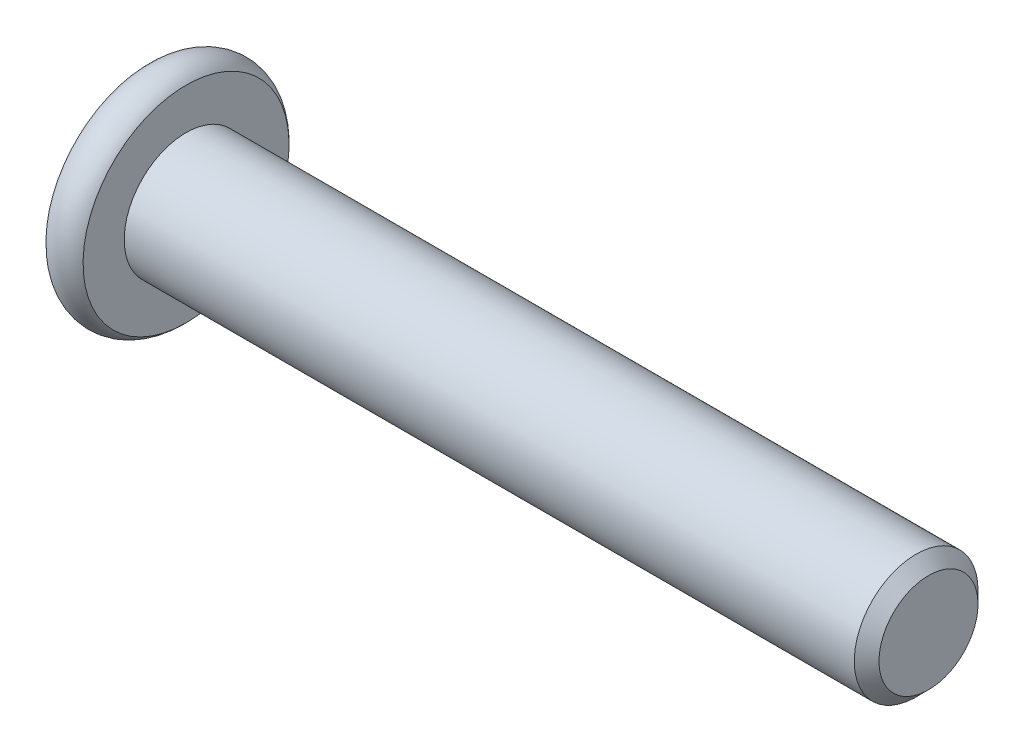
ISO-10303-21;
HEADER;
FILE_DESCRIPTION(('STEP AP214'),'2;1');
FILE_NAME('part.step','',(''),(''),'','','');
FILE_SCHEMA(('AUTOMOTIVE_DESIGN { 1 0 10303 214 1 1 1 1 }'));
ENDSEC;
DATA;
#1=APPLICATION_CONTEXT('core data for automotive mechanical design processes');
#2=APPLICATION_PROTOCOL_DEFINITION('international standard','automotive_design',2000,#1);
#3=PRODUCT_CONTEXT('',#1,'mechanical');
#4=PRODUCT('Part','Part','',(#3));
#5=PRODUCT_RELATED_PRODUCT_CATEGORY('part','',(#4));
#6=PRODUCT_DEFINITION_FORMATION('','',#4);
#7=PRODUCT_DEFINITION_CONTEXT('part definition',#1,'design');
#8=PRODUCT_DEFINITION('design','',#6,#7);
#9=PRODUCT_DEFINITION_SHAPE('','',#8);
#10=(LENGTH_UNIT() NAMED_UNIT(*) SI_UNIT(.MILLI.,.METRE.));
#11=(NAMED_UNIT(*) PLANE_ANGLE_UNIT() SI_UNIT($,.RADIAN.));
#12=(NAMED_UNIT(*) SI_UNIT($,.STERADIAN.) SOLID_ANGLE_UNIT());
#13=UNCERTAINTY_MEASURE_WITH_UNIT(LENGTH_MEASURE(1.E-05),#10,'distance_accuracy_value','');
#14=(GEOMETRIC_REPRESENTATION_CONTEXT(3) GLOBAL_UNCERTAINTY_ASSIGNED_CONTEXT((#13)) GLOBAL_UNIT_ASSIGNED_CONTEXT((#10,
#11,#12)) REPRESENTATION_CONTEXT('',''));
#15=CARTESIAN_POINT('',(0.,0.,0.));
#16=DIRECTION('',(0.,0.,1.));
#17=DIRECTION('',(1.,0.,0.));
#18=AXIS2_PLACEMENT_3D('',#15,#16,#17);
#19=CARTESIAN_POINT('',(-30.,0.,0.));
#20=DIRECTION('',(1.,0.,0.));
#21=DIRECTION('',(0.,0.,-1.));
#22=AXIS2_PLACEMENT_3D('',#19,#20,#21);
#23=CYLINDRICAL_SURFACE('',#22,2.5);
#24=CARTESIAN_POINT('',(-0.500000000000004,0.,0.));
#25=DIRECTION('',(1.,0.,0.));
#26=DIRECTION('',(0.,0.,-1.));
#27=AXIS2_PLACEMENT_3D('',#24,#25,#26);
#28=CIRCLE('',#27,2.5);
#29=CARTESIAN_POINT('',(-0.500000000000004,0.,-2.5));
#30=VERTEX_POINT('',#29);
#31=EDGE_CURVE('E45',#30,#30,#28,.F.);
#32=ORIENTED_EDGE('',*,*,#31,.T.);
#33=EDGE_LOOP('',(#32));
#34=FACE_BOUND('',#33,.T.);
#35=CARTESIAN_POINT('',(-30.,0.,0.));
#36=DIRECTION('',(-1.,0.,0.));
#37=DIRECTION('',(0.,-1.,0.));
#38=AXIS2_PLACEMENT_3D('',#35,#36,#37);
#39=CIRCLE('',#38,2.5);
#40=CARTESIAN_POINT('',(-30.,-2.50000000000001,0.));
#41=VERTEX_POINT('',#40);
#42=EDGE_CURVE('E121',#41,#41,#39,.F.);
#43=ORIENTED_EDGE('',*,*,#42,.T.);
#44=EDGE_LOOP('',(#43));
#45=FACE_BOUND('',#44,.T.);
#46=ADVANCED_FACE('F32',(#34,#45),#23,.T.);
#47=CARTESIAN_POINT('',(0.,0.,0.));
#48=DIRECTION('',(1.,0.,0.));
#49=DIRECTION('',(0.,0.,-1.));
#50=AXIS2_PLACEMENT_3D('',#47,#48,#49);
#51=PLANE('',#50);
#52=CARTESIAN_POINT('',(0.,0.,0.));
#53=DIRECTION('',(1.,0.,0.));
#54=DIRECTION('',(0.,0.,-1.));
#55=AXIS2_PLACEMENT_3D('',#52,#53,#54);
#56=CIRCLE('',#55,1.99999999999999);
#57=CARTESIAN_POINT('',(0.,0.,-1.99999999999999));
#58=VERTEX_POINT('',#57);
#59=EDGE_CURVE('E124',#58,#58,#56,.T.);
#60=ORIENTED_EDGE('',*,*,#59,.T.);
#61=EDGE_LOOP('',(#60));
#62=FACE_BOUND('',#61,.T.);
#63=ADVANCED_FACE('F134',(#62),#51,.T.);
#64=CARTESIAN_POINT('',(0.,0.,0.));
#65=DIRECTION('',(-1.,0.,0.));
#66=DIRECTION('',(0.,0.,1.));
#67=AXIS2_PLACEMENT_3D('',#64,#65,#66);
#68=CONICAL_SURFACE('',#67,1.99999999999999,0.785398163397447);
#69=ORIENTED_EDGE('',*,*,#31,.F.);
#70=EDGE_LOOP('',(#69));
#71=FACE_BOUND('',#70,.T.);
#72=ORIENTED_EDGE('',*,*,#59,.F.);
#73=EDGE_LOOP('',(#72));
#74=FACE_BOUND('',#73,.T.);
#75=ADVANCED_FACE('F34',(#71,#74),#68,.T.);
#76=CARTESIAN_POINT('',(-31.5,0.,0.));
#77=DIRECTION('',(1.,0.,0.));
#78=DIRECTION('',(0.,1.,0.));
#79=AXIS2_PLACEMENT_3D('',#76,#77,#78);
#80=PLANE('',#79);
#81=CARTESIAN_POINT('',(-31.5,1.20258491862594E-13,0.));
#82=DIRECTION('',(-1.,0.,0.));
#83=DIRECTION('',(0.,-1.,0.));
#84=AXIS2_PLACEMENT_3D('',#81,#82,#83);
#85=CIRCLE('',#84,1.78205080756884);
#86=CARTESIAN_POINT('',(-31.5,-1.78205080756872,0.));
#87=VERTEX_POINT('',#86);
#88=EDGE_CURVE('E234',#87,#87,#85,.T.);
#89=ORIENTED_EDGE('',*,*,#88,.F.);
#90=EDGE_LOOP('',(#89));
#91=FACE_BOUND('',#90,.T.);
#92=CARTESIAN_POINT('',(-31.5,0.,0.));
#93=DIRECTION('',(-1.,0.,0.));
#94=DIRECTION('',(0.,-1.,0.));
#95=AXIS2_PLACEMENT_3D('',#92,#93,#94);
#96=CIRCLE('',#95,4.16143782776615);
#97=CARTESIAN_POINT('',(-31.5,-4.16143782776615,0.));
#98=VERTEX_POINT('',#97);
#99=EDGE_CURVE('E118',#98,#98,#96,.T.);
#100=ORIENTED_EDGE('',*,*,#99,.T.);
#101=EDGE_LOOP('',(#100));
#102=FACE_BOUND('',#101,.T.);
#103=ADVANCED_FACE('F133',(#91,#102),#80,.F.);
#104=CARTESIAN_POINT('',(-30.75,0.,0.));
#105=DIRECTION('',(-1.,0.,0.));
#106=DIRECTION('',(0.,-1.,0.));
#107=AXIS2_PLACEMENT_3D('',#104,#105,#106);
#108=TOROIDAL_SURFACE('',#107,3.5,1.);
#109=ORIENTED_EDGE('',*,*,#99,.F.);
#110=EDGE_LOOP('',(#109));
#111=FACE_BOUND('',#110,.T.);
#112=CARTESIAN_POINT('',(-30.,0.,0.));
#113=DIRECTION('',(-1.,0.,0.));
#114=DIRECTION('',(0.,-1.,0.));
#115=AXIS2_PLACEMENT_3D('',#112,#113,#114);
#116=CIRCLE('',#115,4.16143782776615);
#117=CARTESIAN_POINT('',(-30.,-4.16143782776615,0.));
#118=VERTEX_POINT('',#117);
#119=EDGE_CURVE('E115',#118,#118,#116,.T.);
#120=ORIENTED_EDGE('',*,*,#119,.T.);
#121=EDGE_LOOP('',(#120));
#122=FACE_BOUND('',#121,.T.);
#123=ADVANCED_FACE('F145',(#111,#122),#108,.T.);
#124=CARTESIAN_POINT('',(-30.,4.16143782776615,0.));
#125=DIRECTION('',(-1.,0.,0.));
#126=DIRECTION('',(0.,-1.,0.));
#127=AXIS2_PLACEMENT_3D('',#124,#125,#126);
#128=PLANE('',#127);
#129=ORIENTED_EDGE('',*,*,#42,.F.);
#130=EDGE_LOOP('',(#129));
#131=FACE_BOUND('',#130,.T.);
#132=ORIENTED_EDGE('',*,*,#119,.F.);
#133=EDGE_LOOP('',(#132));
#134=FACE_BOUND('',#133,.T.);
#135=ADVANCED_FACE('F149',(#131,#134),#128,.F.);
#136=CARTESIAN_POINT('',(-31.5,1.20258491862594E-13,0.));
#137=DIRECTION('',(-1.,0.,0.));
#138=DIRECTION('',(0.,-1.,0.));
#139=AXIS2_PLACEMENT_3D('',#136,#137,#138);
#140=CONICAL_SURFACE('',#139,1.78205080756884,0.78539816339745);
#141=ORIENTED_EDGE('',*,*,#88,.T.);
#142=EDGE_LOOP('',(#141));
#143=FACE_BOUND('',#142,.T.);
#144=CARTESIAN_POINT('',(-32.015428085613,-1.74023253176568,1.5));
#145=CARTESIAN_POINT('',(-31.9833811073445,-1.69791724929722,1.5));
#146=CARTESIAN_POINT('',(-31.9516444672841,-1.65536760966783,1.5));
#147=CARTESIAN_POINT('',(-31.8889203936153,-1.56970398156676,1.5));
#148=CARTESIAN_POINT('',(-31.85793314822,-1.52658985542839,1.5));
#149=CARTESIAN_POINT('',(-31.765846164345,-1.39562626326554,1.5));
#150=CARTESIAN_POINT('',(-31.7061145123021,-1.30679868010567,1.5));
#151=CARTESIAN_POINT('',(-31.5887342891012,-1.12044622640206,1.5));
#152=CARTESIAN_POINT('',(-31.5314082774823,-1.02271587306664,1.5));
#153=CARTESIAN_POINT('',(-31.426463214976,-0.82235721496517,1.5));
#154=CARTESIAN_POINT('',(-31.3788114236896,-0.719746931701835,1.5));
#155=CARTESIAN_POINT('',(-31.3205099883151,-0.56585238709501,1.5));
#156=CARTESIAN_POINT('',(-31.3037990535409,-0.516874191424599,1.5));
#157=CARTESIAN_POINT('',(-31.2743077515089,-0.417723988457438,1.5));
#158=CARTESIAN_POINT('',(-31.2615276514219,-0.367551900263805,1.5));
#159=CARTESIAN_POINT('',(-31.2407784202458,-0.267158299056056,1.5));
#160=CARTESIAN_POINT('',(-31.232726061826,-0.216954261864791,1.5));
#161=CARTESIAN_POINT('',(-31.2215916368341,-0.115994915871257,1.5));
#162=CARTESIAN_POINT('',(-31.2185086886377,-0.065239706461475,1.5));
#163=CARTESIAN_POINT('',(-31.2175473897404,0.0344222234876207,1.5));
#164=CARTESIAN_POINT('',(-31.2194789216952,0.0833271701101549,1.5));
#165=CARTESIAN_POINT('',(-31.2280175729677,0.180724293127287,1.5));
#166=CARTESIAN_POINT('',(-31.234625142048,0.229216429361795,1.5));
#167=CARTESIAN_POINT('',(-31.2522650626447,0.326258027697074,1.5));
#168=CARTESIAN_POINT('',(-31.263373168201,0.374793507450095,1.5));
#169=CARTESIAN_POINT('',(-31.2894198669595,0.470802295834248,1.5));
#170=CARTESIAN_POINT('',(-31.3043581560035,0.518275688481351,1.5));
#171=CARTESIAN_POINT('',(-31.356839545716,0.667150562065199,1.5));
#172=CARTESIAN_POINT('',(-31.4003351165442,0.766448362426918,1.5));
#173=CARTESIAN_POINT('',(-31.4970587814836,0.960384405673904,1.5));
#174=CARTESIAN_POINT('',(-31.5503217226675,1.05500437383628,1.5));
#175=CARTESIAN_POINT('',(-31.6602258010454,1.23584520321539,1.5));
#176=CARTESIAN_POINT('',(-31.7165682531046,1.32224986946557,1.5));
#177=CARTESIAN_POINT('',(-31.803675572597,1.4495495372648,1.5));
#178=CARTESIAN_POINT('',(-31.8330199906839,1.4914336848243,1.5));
#179=CARTESIAN_POINT('',(-31.8924869182931,1.57462914783251,1.5));
#180=CARTESIAN_POINT('',(-31.9226092115007,1.61594061772586,1.5));
#181=CARTESIAN_POINT('',(-31.9530541181366,1.6570135874256,1.5));
#182=B_SPLINE_CURVE_WITH_KNOTS('',3,(#144,#145,#146,#147,#148,#149,#150,#151,#152,#153,#154,
#155,#156,#157,#158,#159,#160,#161,#162,#163,#164,#165,#166,#167,#168,#169,#170,#171,#172,#173,
#174,#175,#176,#177,#178,#179,#180,#181),.UNSPECIFIED.,.F.,.F.,(4,2,2,2,2,2,2,2,2,2,2,2,2,2,2,2,
2,2,4),(0.,0.159238974218351,0.318517535014541,0.639504781932385,0.979137893799192,
1.31760168934356,1.47272233841622,1.62785352839774,1.78016486537345,1.93244917778277,
2.07904486260296,2.22565464958331,2.37484213303397,2.52401777304038,2.84828365283773,
3.17372975666748,3.48303030530535,3.63644667013906,3.78982082222911),.UNSPECIFIED.);
#183=CARTESIAN_POINT('',(-31.45,-0.866025403784319,1.5));
#184=VERTEX_POINT('',#183);
#185=CARTESIAN_POINT('',(-31.45,0.866025403784558,1.5));
#186=VERTEX_POINT('',#185);
#187=EDGE_CURVE('E99',#184,#186,#182,.T.);
#188=ORIENTED_EDGE('',*,*,#187,.F.);
#189=CARTESIAN_POINT('',(-31.4501154816001,-1.73216627762259,-0.000200000000001104));
#190=CARTESIAN_POINT('',(-31.4203654760674,-1.70239359975903,0.0513677907370739));
#191=CARTESIAN_POINT('',(-31.3923624839104,-1.67212305186343,0.103797917665198));
#192=CARTESIAN_POINT('',(-31.3410892304402,-1.61039789003607,0.210709034055593));
#193=CARTESIAN_POINT('',(-31.3178475050444,-1.57893740312602,0.265200195814658));
#194=CARTESIAN_POINT('',(-31.2780337289923,-1.51549879897975,0.375079081357247));
#195=CARTESIAN_POINT('',(-31.2613615856709,-1.48353684526798,0.430438809095198));
#196=CARTESIAN_POINT('',(-31.2356744568181,-1.41890915196199,0.54237725747715));
#197=CARTESIAN_POINT('',(-31.2266402904789,-1.38624538781106,0.598952556553008));
#198=CARTESIAN_POINT('',(-31.2184890812269,-1.32995210095288,0.69645538951644));
#199=CARTESIAN_POINT('',(-31.2172822529893,-1.30639533311112,0.737256908280466));
#200=CARTESIAN_POINT('',(-31.2193140571623,-1.25932335290182,0.818787969615858));
#201=CARTESIAN_POINT('',(-31.2225536707483,-1.23580815085301,0.859517494314629));
#202=CARTESIAN_POINT('',(-31.233291985982,-1.18900414978415,0.940584402163415));
#203=CARTESIAN_POINT('',(-31.2407946530188,-1.16571558211708,0.980921384598288));
#204=CARTESIAN_POINT('',(-31.2596516119283,-1.11952932016323,1.06091833691403));
#205=CARTESIAN_POINT('',(-31.2710075570186,-1.09663179808774,1.10057800851621));
#206=CARTESIAN_POINT('',(-31.3047216475927,-1.03798159809686,1.20216313477448));
#207=CARTESIAN_POINT('',(-31.3296218490934,-1.00259267147453,1.26345855370969));
#208=CARTESIAN_POINT('',(-31.3716566532716,-0.950557780604255,1.35358562846331));
#209=CARTESIAN_POINT('',(-31.3864251535591,-0.933410759677029,1.38328513990771));
#210=CARTESIAN_POINT('',(-31.4173105659402,-0.899432101996288,1.44213790138375));
#211=CARTESIAN_POINT('',(-31.4334268341217,-0.882600319285591,1.47129140422064));
#212=CARTESIAN_POINT('',(-31.4501154816001,-0.865909933730481,1.5002));
#213=B_SPLINE_CURVE_WITH_KNOTS('',3,(#189,#190,#191,#192,#193,#194,#195,#196,#197,#198,#199,
#200,#201,#202,#203,#204,#205,#206,#207,#208,#209,#210,#211,#212),.UNSPECIFIED.,.F.,.F.,(4,2,2,
2,2,2,2,2,2,2,2,4),(0.,0.199829143693301,0.400822987382388,0.598623720538181,0.79592624018889,
0.937113067959882,1.07833105577193,1.21968061668222,1.36109089931054,1.58570969637566,
1.69770705470963,1.80965120737194),.UNSPECIFIED.);
#214=CARTESIAN_POINT('',(-31.45,-1.73205080756876,0.));
#215=VERTEX_POINT('',#214);
#216=EDGE_CURVE('E191',#215,#184,#213,.T.);
#217=ORIENTED_EDGE('',*,*,#216,.F.);
#218=CARTESIAN_POINT('',(-31.4501154816001,-0.86590993373048,-1.5002));
#219=CARTESIAN_POINT('',(-31.4203654760674,-0.895682611594045,-1.44863220926292));
#220=CARTESIAN_POINT('',(-31.3923624839104,-0.925953159489644,-1.3962020823348));
#221=CARTESIAN_POINT('',(-31.3410892304402,-0.987678321317002,-1.2892909659444));
#222=CARTESIAN_POINT('',(-31.3178475050444,-1.01913880822705,-1.23479980418534));
#223=CARTESIAN_POINT('',(-31.2780337289923,-1.08257741237332,-1.12492091864275));
#224=CARTESIAN_POINT('',(-31.2613615856709,-1.11453936608509,-1.0695611909048));
#225=CARTESIAN_POINT('',(-31.2356744568181,-1.17916705939108,-0.957622742522852));
#226=CARTESIAN_POINT('',(-31.2266402904789,-1.21183082354201,-0.901047443446994));
#227=CARTESIAN_POINT('',(-31.2184890812269,-1.2681241104002,-0.803544610483562));
#228=CARTESIAN_POINT('',(-31.2172822529893,-1.29168087824196,-0.762743091719536));
#229=CARTESIAN_POINT('',(-31.2193140571623,-1.33875285845126,-0.681212030384144));
#230=CARTESIAN_POINT('',(-31.2225536707483,-1.36226806050006,-0.640482505685373));
#231=CARTESIAN_POINT('',(-31.233291985982,-1.40907206156893,-0.559415597836587));
#232=CARTESIAN_POINT('',(-31.2407946530188,-1.432360629236,-0.519078615401715));
#233=CARTESIAN_POINT('',(-31.2596516119283,-1.47854689118984,-0.439081663085972));
#234=CARTESIAN_POINT('',(-31.2710075570186,-1.50144441326533,-0.399421991483795));
#235=CARTESIAN_POINT('',(-31.3047216475927,-1.56009461325621,-0.297836865225516));
#236=CARTESIAN_POINT('',(-31.3296218490934,-1.59548353987854,-0.236541446290311));
#237=CARTESIAN_POINT('',(-31.3716566532716,-1.64751843074882,-0.146414371536687));
#238=CARTESIAN_POINT('',(-31.3864251535591,-1.66466545167605,-0.116714860092284));
#239=CARTESIAN_POINT('',(-31.4173105659402,-1.69864410935679,-0.0578620986162512));
#240=CARTESIAN_POINT('',(-31.4334268341218,-1.71547589206749,-0.0287085957793639));
#241=CARTESIAN_POINT('',(-31.4501154816001,-1.73216627762259,0.000200000000000142));
#242=B_SPLINE_CURVE_WITH_KNOTS('',3,(#218,#219,#220,#221,#222,#223,#224,#225,#226,#227,#228,
#229,#230,#231,#232,#233,#234,#235,#236,#237,#238,#239,#240,#241),.UNSPECIFIED.,.F.,.F.,(4,2,2,
2,2,2,2,2,2,2,2,4),(0.,0.199829143693303,0.400822987382383,0.598623720538177,0.795926240188885,
0.937113067959877,1.07833105577192,1.21968061668221,1.36109089931054,1.58570969637565,
1.69770705470963,1.80965120737194),.UNSPECIFIED.);
#243=CARTESIAN_POINT('',(-31.45,-0.866025403784317,-1.5));
#244=VERTEX_POINT('',#243);
#245=EDGE_CURVE('E186',#244,#215,#242,.T.);
#246=ORIENTED_EDGE('',*,*,#245,.F.);
#247=CARTESIAN_POINT('',(-32.015428085613,-1.74023253176568,-1.5));
#248=CARTESIAN_POINT('',(-31.9833811073445,-1.69791724929721,-1.5));
#249=CARTESIAN_POINT('',(-31.9516444672841,-1.65536760966782,-1.5));
#250=CARTESIAN_POINT('',(-31.8889203936153,-1.56970398156675,-1.5));
#251=CARTESIAN_POINT('',(-31.85793314822,-1.52658985542839,-1.5));
#252=CARTESIAN_POINT('',(-31.765846164345,-1.39562626326554,-1.5));
#253=CARTESIAN_POINT('',(-31.7061145123021,-1.30679868010566,-1.5));
#254=CARTESIAN_POINT('',(-31.5887342891013,-1.12044622640206,-1.5));
#255=CARTESIAN_POINT('',(-31.5314082774823,-1.02271587306663,-1.5));
#256=CARTESIAN_POINT('',(-31.426463214976,-0.822357214965168,-1.5));
#257=CARTESIAN_POINT('',(-31.3788114236896,-0.719746931701833,-1.5));
#258=CARTESIAN_POINT('',(-31.3205099883151,-0.565852387095008,-1.5));
#259=CARTESIAN_POINT('',(-31.3037990535409,-0.516874191424597,-1.5));
#260=CARTESIAN_POINT('',(-31.2743077515089,-0.417723988457436,-1.5));
#261=CARTESIAN_POINT('',(-31.2615276514219,-0.367551900263803,-1.5));
#262=CARTESIAN_POINT('',(-31.2407784202458,-0.267158299056054,-1.5));
#263=CARTESIAN_POINT('',(-31.232726061826,-0.21695426186479,-1.5));
#264=CARTESIAN_POINT('',(-31.2215916368341,-0.115994915871256,-1.5));
#265=CARTESIAN_POINT('',(-31.2185086886377,-0.0652397064614737,-1.5));
#266=CARTESIAN_POINT('',(-31.2175473897404,0.0344222234876214,-1.5));
#267=CARTESIAN_POINT('',(-31.2194789216952,0.083327170110155,-1.5));
#268=CARTESIAN_POINT('',(-31.2280175729677,0.180724293127287,-1.5));
#269=CARTESIAN_POINT('',(-31.234625142048,0.229216429361795,-1.5));
#270=CARTESIAN_POINT('',(-31.2522650626447,0.326258027697074,-1.5));
#271=CARTESIAN_POINT('',(-31.263373168201,0.374793507450094,-1.5));
#272=CARTESIAN_POINT('',(-31.2894198669595,0.470802295834248,-1.5));
#273=CARTESIAN_POINT('',(-31.3043581560035,0.51827568848135,-1.5));
#274=CARTESIAN_POINT('',(-31.356839545716,0.667150562065198,-1.5));
#275=CARTESIAN_POINT('',(-31.4003351165442,0.766448362426916,-1.5));
#276=CARTESIAN_POINT('',(-31.4970587814836,0.960384405673901,-1.5));
#277=CARTESIAN_POINT('',(-31.5503217226675,1.05500437383627,-1.5));
#278=CARTESIAN_POINT('',(-31.6602258010454,1.23584520321538,-1.5));
#279=CARTESIAN_POINT('',(-31.7165682531046,1.32224986946556,-1.5));
#280=CARTESIAN_POINT('',(-31.803675572597,1.4495495372648,-1.5));
#281=CARTESIAN_POINT('',(-31.8330199906839,1.4914336848243,-1.5));
#282=CARTESIAN_POINT('',(-31.8924869182931,1.57462914783251,-1.5));
#283=CARTESIAN_POINT('',(-31.9226092115007,1.61594061772586,-1.5));
#284=CARTESIAN_POINT('',(-31.9530541181366,1.6570135874256,-1.5));
#285=B_SPLINE_CURVE_WITH_KNOTS('',3,(#247,#248,#249,#250,#251,#252,#253,#254,#255,#256,#257,
#258,#259,#260,#261,#262,#263,#264,#265,#266,#267,#268,#269,#270,#271,#272,#273,#274,#275,#276,
#277,#278,#279,#280,#281,#282,#283,#284),.UNSPECIFIED.,.F.,.F.,(4,2,2,2,2,2,2,2,2,2,2,2,2,2,2,2,
2,2,4),(0.,0.159238974218355,0.318517535014539,0.63950478193238,0.979137893799187,
1.31760168934355,1.47272233841622,1.62785352839774,1.78016486537344,1.93244917778277,
2.07904486260295,2.2256546495833,2.37484213303397,2.52401777304037,2.84828365283772,
3.17372975666747,3.48303030530534,3.63644667013906,3.7898208222291),.UNSPECIFIED.);
#286=CARTESIAN_POINT('',(-31.45,0.866025403784559,-1.5));
#287=VERTEX_POINT('',#286);
#288=EDGE_CURVE('E52',#287,#244,#285,.F.);
#289=ORIENTED_EDGE('',*,*,#288,.F.);
#290=CARTESIAN_POINT('',(-31.4501154816001,1.73216627762284,0.000200000000000434));
#291=CARTESIAN_POINT('',(-31.4203654760674,1.70239359975927,-0.0513677907370753));
#292=CARTESIAN_POINT('',(-31.3923624839103,1.67212305186367,-0.1037979176652));
#293=CARTESIAN_POINT('',(-31.3410892304402,1.61039789003631,-0.210709034055596));
#294=CARTESIAN_POINT('',(-31.3178475050444,1.57893740312626,-0.265200195814662));
#295=CARTESIAN_POINT('',(-31.2780337289922,1.51549879897999,-0.375079081357251));
#296=CARTESIAN_POINT('',(-31.2613615856709,1.48353684526822,-0.430438809095202));
#297=CARTESIAN_POINT('',(-31.2356744568181,1.41890915196223,-0.542377257477154));
#298=CARTESIAN_POINT('',(-31.2266402904789,1.3862453878113,-0.598952556553012));
#299=CARTESIAN_POINT('',(-31.2184890812269,1.32995210095311,-0.696455389516444));
#300=CARTESIAN_POINT('',(-31.2172822529892,1.30639533311136,-0.737256908280469));
#301=CARTESIAN_POINT('',(-31.2193140571623,1.25932335290205,-0.818787969615862));
#302=CARTESIAN_POINT('',(-31.2225536707483,1.23580815085325,-0.859517494314633));
#303=CARTESIAN_POINT('',(-31.233291985982,1.18900414978438,-0.940584402163419));
#304=CARTESIAN_POINT('',(-31.2407946530188,1.16571558211731,-0.980921384598291));
#305=CARTESIAN_POINT('',(-31.2596516119283,1.11952932016347,-1.06091833691403));
#306=CARTESIAN_POINT('',(-31.2710075570186,1.09663179808798,-1.10057800851621));
#307=CARTESIAN_POINT('',(-31.3047216475927,1.0379815980971,-1.20216313477449));
#308=CARTESIAN_POINT('',(-31.3296218490934,1.00259267147477,-1.26345855370969));
#309=CARTESIAN_POINT('',(-31.3716566532716,0.950557780604495,-1.35358562846331));
#310=CARTESIAN_POINT('',(-31.3864251535591,0.933410759677267,-1.38328513990772));
#311=CARTESIAN_POINT('',(-31.4173105659402,0.899432101996527,-1.44213790138375));
#312=CARTESIAN_POINT('',(-31.4334268341217,0.88260031928583,-1.47129140422064));
#313=CARTESIAN_POINT('',(-31.4501154816001,0.865909933730722,-1.5002));
#314=B_SPLINE_CURVE_WITH_KNOTS('',3,(#290,#291,#292,#293,#294,#295,#296,#297,#298,#299,#300,
#301,#302,#303,#304,#305,#306,#307,#308,#309,#310,#311,#312,#313),.UNSPECIFIED.,.F.,.F.,(4,2,2,
2,2,2,2,2,2,2,2,4),(0.,0.199829143693303,0.400822987382392,0.598623720538185,0.795926240188894,
0.937113067959886,1.07833105577193,1.21968061668222,1.36109089931055,1.58570969637566,
1.69770705470964,1.80965120737194),.UNSPECIFIED.);
#315=CARTESIAN_POINT('',(-31.45,1.732050807569,0.));
#316=VERTEX_POINT('',#315);
#317=EDGE_CURVE('E11',#316,#287,#314,.T.);
#318=ORIENTED_EDGE('',*,*,#317,.F.);
#319=CARTESIAN_POINT('',(-31.4501154816001,0.865909933730722,1.5002));
#320=CARTESIAN_POINT('',(-31.4203654760673,0.895682611594286,1.44863220926292));
#321=CARTESIAN_POINT('',(-31.3923624839103,0.925953159489885,1.3962020823348));
#322=CARTESIAN_POINT('',(-31.3410892304402,0.987678321317244,1.2892909659444));
#323=CARTESIAN_POINT('',(-31.3178475050444,1.01913880822729,1.23479980418534));
#324=CARTESIAN_POINT('',(-31.2780337289923,1.08257741237356,1.12492091864275));
#325=CARTESIAN_POINT('',(-31.2613615856709,1.11453936608533,1.0695611909048));
#326=CARTESIAN_POINT('',(-31.2356744568181,1.17916705939132,0.95762274252285));
#327=CARTESIAN_POINT('',(-31.2266402904789,1.21183082354225,0.901047443446991));
#328=CARTESIAN_POINT('',(-31.2184890812269,1.26812411040044,0.803544610483558));
#329=CARTESIAN_POINT('',(-31.2172822529892,1.2916808782422,0.762743091719532));
#330=CARTESIAN_POINT('',(-31.2193140571623,1.3387528584515,0.68121203038414));
#331=CARTESIAN_POINT('',(-31.2225536707483,1.3622680605003,0.640482505685369));
#332=CARTESIAN_POINT('',(-31.233291985982,1.40907206156917,0.559415597836582));
#333=CARTESIAN_POINT('',(-31.2407946530188,1.43236062923624,0.51907861540171));
#334=CARTESIAN_POINT('',(-31.2596516119283,1.47854689119008,0.439081663085968));
#335=CARTESIAN_POINT('',(-31.2710075570186,1.50144441326557,0.399421991483791));
#336=CARTESIAN_POINT('',(-31.3047216475927,1.56009461325645,0.297836865225514));
#337=CARTESIAN_POINT('',(-31.3296218490934,1.59548353987878,0.236541446290311));
#338=CARTESIAN_POINT('',(-31.3716566532716,1.64751843074906,0.146414371536687));
#339=CARTESIAN_POINT('',(-31.3864251535591,1.66466545167629,0.116714860092283));
#340=CARTESIAN_POINT('',(-31.4173105659402,1.69864410935703,0.05786209861625));
#341=CARTESIAN_POINT('',(-31.4334268341217,1.71547589206773,0.028708595779363));
#342=CARTESIAN_POINT('',(-31.4501154816001,1.73216627762284,-0.000199999999999184));
#343=B_SPLINE_CURVE_WITH_KNOTS('',3,(#319,#320,#321,#322,#323,#324,#325,#326,#327,#328,#329,
#330,#331,#332,#333,#334,#335,#336,#337,#338,#339,#340,#341,#342),.UNSPECIFIED.,.F.,.F.,(4,2,2,
2,2,2,2,2,2,2,2,4),(0.,0.199829143693302,0.400822987382384,0.598623720538177,0.795926240188887,
0.937113067959879,1.07833105577193,1.21968061668222,1.36109089931054,1.58570969637565,
1.69770705470963,1.80965120737193),.UNSPECIFIED.);
#344=EDGE_CURVE('E90',#186,#316,#343,.T.);
#345=ORIENTED_EDGE('',*,*,#344,.F.);
#346=EDGE_LOOP('',(#188,#217,#246,#289,#318,#345));
#347=FACE_BOUND('',#346,.T.);
#348=ADVANCED_FACE('F89',(#143,#347),#140,.F.);
#349=CARTESIAN_POINT('',(-29.2,2.43608073816923E-13,0.));
#350=DIRECTION('',(-1.,0.,0.));
#351=DIRECTION('',(0.,-1.,0.));
#352=AXIS2_PLACEMENT_3D('',#349,#350,#351);
#353=PLANE('',#352);
#354=DIRECTION('',(0.,0.5,-0.866025403784438));
#355=VECTOR('',#354,1.);
#356=CARTESIAN_POINT('',(-29.2,0.866025403784551,1.5));
#357=LINE('',#356,#355);
#358=CARTESIAN_POINT('',(-29.2,0.866025403784551,1.5));
#359=VERTEX_POINT('',#358);
#360=CARTESIAN_POINT('',(-29.2,1.73205080756899,0.));
#361=VERTEX_POINT('',#360);
#362=EDGE_CURVE('E98',#359,#361,#357,.T.);
#363=ORIENTED_EDGE('',*,*,#362,.T.);
#364=DIRECTION('',(0.,-0.5,-0.866025403784439));
#365=VECTOR('',#364,1.);
#366=CARTESIAN_POINT('',(-29.2,1.73205080756899,0.));
#367=LINE('',#366,#365);
#368=CARTESIAN_POINT('',(-29.2,0.866025403784551,-1.5));
#369=VERTEX_POINT('',#368);
#370=EDGE_CURVE('E103',#361,#369,#367,.T.);
#371=ORIENTED_EDGE('',*,*,#370,.T.);
#372=DIRECTION('',(0.,-1.,0.));
#373=VECTOR('',#372,1.);
#374=CARTESIAN_POINT('',(-29.2,0.866025403784551,-1.5));
#375=LINE('',#374,#373);
#376=CARTESIAN_POINT('',(-29.2,-0.866025403784326,-1.5));
#377=VERTEX_POINT('',#376);
#378=EDGE_CURVE('E216',#369,#377,#375,.T.);
#379=ORIENTED_EDGE('',*,*,#378,.T.);
#380=DIRECTION('',(0.,-0.5,0.866025403784438));
#381=VECTOR('',#380,1.);
#382=CARTESIAN_POINT('',(-29.2,-0.866025403784326,-1.5));
#383=LINE('',#382,#381);
#384=CARTESIAN_POINT('',(-29.2,-1.73205080756877,0.));
#385=VERTEX_POINT('',#384);
#386=EDGE_CURVE('E220',#377,#385,#383,.T.);
#387=ORIENTED_EDGE('',*,*,#386,.T.);
#388=DIRECTION('',(0.,0.5,0.866025403784439));
#389=VECTOR('',#388,1.);
#390=CARTESIAN_POINT('',(-29.2,-1.73205080756877,0.));
#391=LINE('',#390,#389);
#392=CARTESIAN_POINT('',(-29.2,-0.866025403784328,1.5));
#393=VERTEX_POINT('',#392);
#394=EDGE_CURVE('E111',#385,#393,#391,.T.);
#395=ORIENTED_EDGE('',*,*,#394,.T.);
#396=DIRECTION('',(0.,1.,0.));
#397=VECTOR('',#396,1.);
#398=CARTESIAN_POINT('',(-29.2,-0.866025403784328,1.5));
#399=LINE('',#398,#397);
#400=EDGE_CURVE('E106',#393,#359,#399,.T.);
#401=ORIENTED_EDGE('',*,*,#400,.T.);
#402=EDGE_LOOP('',(#363,#371,#379,#387,#395,#401));
#403=FACE_BOUND('',#402,.T.);
#404=ADVANCED_FACE('F173',(#403),#353,.T.);
#405=CARTESIAN_POINT('',(-29.2,1.73205080756899,0.));
#406=DIRECTION('',(0.,0.866025403784439,-0.5));
#407=DIRECTION('',(0.,0.5,0.866025403784439));
#408=AXIS2_PLACEMENT_3D('',#405,#406,#407);
#409=PLANE('',#408);
#410=DIRECTION('',(-1.,0.,0.));
#411=VECTOR('',#410,1.);
#412=CARTESIAN_POINT('',(-29.2,1.73205080756899,0.));
#413=LINE('',#412,#411);
#414=EDGE_CURVE('E96',#361,#316,#413,.T.);
#415=ORIENTED_EDGE('',*,*,#414,.T.);
#416=ORIENTED_EDGE('',*,*,#317,.T.);
#417=DIRECTION('',(-1.,0.,0.));
#418=VECTOR('',#417,1.);
#419=CARTESIAN_POINT('',(-29.2,0.866025403784551,-1.5));
#420=LINE('',#419,#418);
#421=EDGE_CURVE('E105',#369,#287,#420,.T.);
#422=ORIENTED_EDGE('',*,*,#421,.F.);
#423=ORIENTED_EDGE('',*,*,#370,.F.);
#424=EDGE_LOOP('',(#415,#416,#422,#423));
#425=FACE_BOUND('',#424,.T.);
#426=ADVANCED_FACE('F101',(#425),#409,.F.);
#427=CARTESIAN_POINT('',(-29.2,0.866025403784551,-1.5));
#428=DIRECTION('',(0.,0.,-1.));
#429=DIRECTION('',(-1.,0.,0.));
#430=AXIS2_PLACEMENT_3D('',#427,#428,#429);
#431=PLANE('',#430);
#432=ORIENTED_EDGE('',*,*,#421,.T.);
#433=ORIENTED_EDGE('',*,*,#288,.T.);
#434=DIRECTION('',(-1.,0.,0.));
#435=VECTOR('',#434,1.);
#436=CARTESIAN_POINT('',(-29.2,-0.866025403784326,-1.5));
#437=LINE('',#436,#435);
#438=EDGE_CURVE('E108',#377,#244,#437,.T.);
#439=ORIENTED_EDGE('',*,*,#438,.F.);
#440=ORIENTED_EDGE('',*,*,#378,.F.);
#441=EDGE_LOOP('',(#432,#433,#439,#440));
#442=FACE_BOUND('',#441,.T.);
#443=ADVANCED_FACE('F205',(#442),#431,.F.);
#444=CARTESIAN_POINT('',(-29.2,-0.866025403784326,-1.5));
#445=DIRECTION('',(0.,-0.866025403784439,-0.5));
#446=DIRECTION('',(0.,0.5,-0.866025403784439));
#447=AXIS2_PLACEMENT_3D('',#444,#445,#446);
#448=PLANE('',#447);
#449=ORIENTED_EDGE('',*,*,#438,.T.);
#450=ORIENTED_EDGE('',*,*,#245,.T.);
#451=DIRECTION('',(-1.,0.,0.));
#452=VECTOR('',#451,1.);
#453=CARTESIAN_POINT('',(-29.2,-1.73205080756877,0.));
#454=LINE('',#453,#452);
#455=EDGE_CURVE('E230',#385,#215,#454,.T.);
#456=ORIENTED_EDGE('',*,*,#455,.F.);
#457=ORIENTED_EDGE('',*,*,#386,.F.);
#458=EDGE_LOOP('',(#449,#450,#456,#457));
#459=FACE_BOUND('',#458,.T.);
#460=ADVANCED_FACE('F200',(#459),#448,.F.);
#461=CARTESIAN_POINT('',(-29.2,-1.73205080756877,0.));
#462=DIRECTION('',(0.,-0.866025403784439,0.5));
#463=DIRECTION('',(0.,-0.5,-0.866025403784439));
#464=AXIS2_PLACEMENT_3D('',#461,#462,#463);
#465=PLANE('',#464);
#466=ORIENTED_EDGE('',*,*,#455,.T.);
#467=ORIENTED_EDGE('',*,*,#216,.T.);
#468=DIRECTION('',(-1.,0.,0.));
#469=VECTOR('',#468,1.);
#470=CARTESIAN_POINT('',(-29.2,-0.866025403784328,1.5));
#471=LINE('',#470,#469);
#472=EDGE_CURVE('E227',#393,#184,#471,.T.);
#473=ORIENTED_EDGE('',*,*,#472,.F.);
#474=ORIENTED_EDGE('',*,*,#394,.F.);
#475=EDGE_LOOP('',(#466,#467,#473,#474));
#476=FACE_BOUND('',#475,.T.);
#477=ADVANCED_FACE('F197',(#476),#465,.F.);
#478=CARTESIAN_POINT('',(-29.2,-0.866025403784328,1.5));
#479=DIRECTION('',(0.,0.,1.));
#480=DIRECTION('',(1.,0.,0.));
#481=AXIS2_PLACEMENT_3D('',#478,#479,#480);
#482=PLANE('',#481);
#483=ORIENTED_EDGE('',*,*,#472,.T.);
#484=ORIENTED_EDGE('',*,*,#187,.T.);
#485=DIRECTION('',(-1.,0.,0.));
#486=VECTOR('',#485,1.);
#487=CARTESIAN_POINT('',(-29.2,0.866025403784551,1.5));
#488=LINE('',#487,#486);
#489=EDGE_CURVE('E59',#359,#186,#488,.T.);
#490=ORIENTED_EDGE('',*,*,#489,.F.);
#491=ORIENTED_EDGE('',*,*,#400,.F.);
#492=EDGE_LOOP('',(#483,#484,#490,#491));
#493=FACE_BOUND('',#492,.T.);
#494=ADVANCED_FACE('F156',(#493),#482,.F.);
#495=CARTESIAN_POINT('',(-29.2,0.866025403784551,1.5));
#496=DIRECTION('',(0.,0.866025403784439,0.5));
#497=DIRECTION('',(0.,-0.5,0.866025403784439));
#498=AXIS2_PLACEMENT_3D('',#495,#496,#497);
#499=PLANE('',#498);
#500=ORIENTED_EDGE('',*,*,#489,.T.);
#501=ORIENTED_EDGE('',*,*,#344,.T.);
#502=ORIENTED_EDGE('',*,*,#414,.F.);
#503=ORIENTED_EDGE('',*,*,#362,.F.);
#504=EDGE_LOOP('',(#500,#501,#502,#503));
#505=FACE_BOUND('',#504,.T.);
#506=ADVANCED_FACE('F95',(#505),#499,.F.);
#507=CLOSED_SHELL('',(#46,#63,#75,#103,#123,#135,#348,#404,#426,#443,#460,#477,#494,#506));
#508=MANIFOLD_SOLID_BREP('B2',#507);
#509=ADVANCED_BREP_SHAPE_REPRESENTATION('',(#18,#508),#14);
#510=SHAPE_DEFINITION_REPRESENTATION(#9,#509);
ENDSEC;
END-ISO-10303-21;
